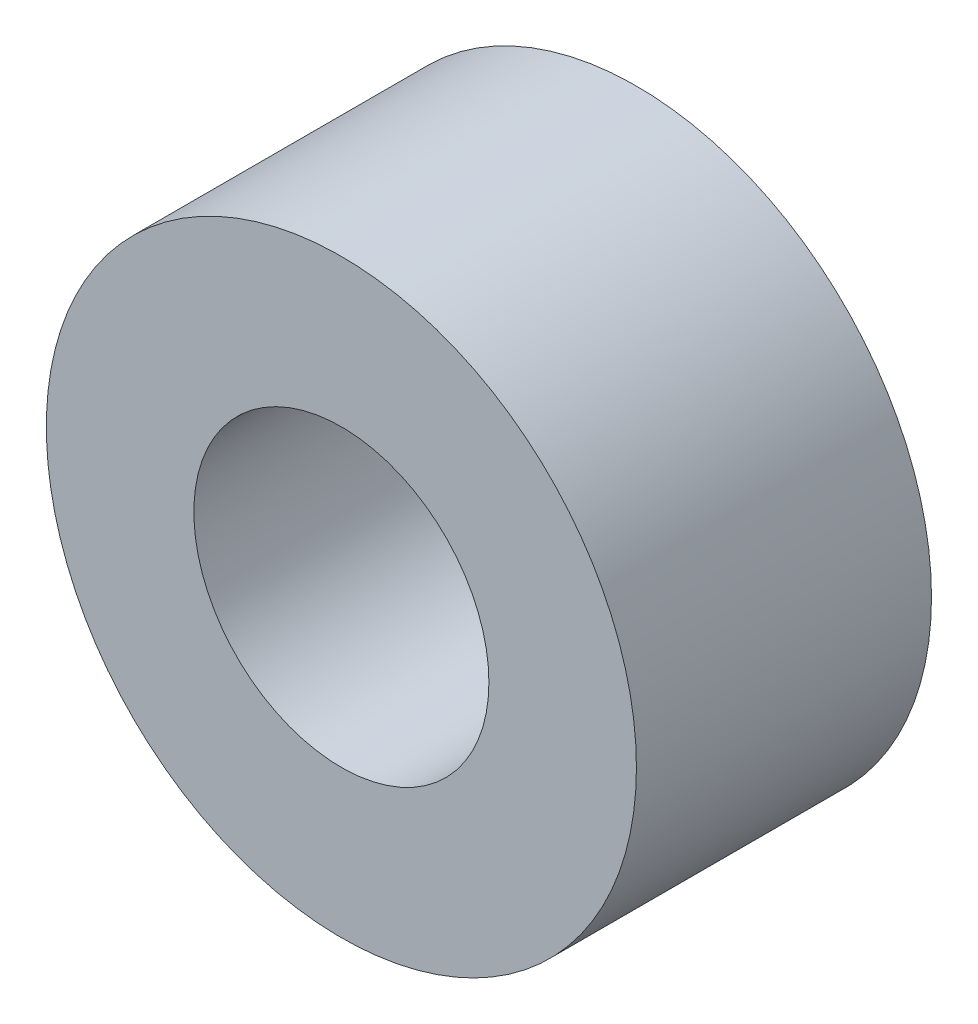
ISO-10303-21;
HEADER;
FILE_DESCRIPTION(('STEP AP214'),'2;1');
FILE_NAME('part.step','',(''),(''),'','','');
FILE_SCHEMA(('AUTOMOTIVE_DESIGN { 1 0 10303 214 1 1 1 1 }'));
ENDSEC;
DATA;
#1=APPLICATION_CONTEXT('core data for automotive mechanical design processes');
#2=APPLICATION_PROTOCOL_DEFINITION('international standard','automotive_design',2000,#1);
#3=PRODUCT_CONTEXT('',#1,'mechanical');
#4=PRODUCT('Part','Part','',(#3));
#5=PRODUCT_RELATED_PRODUCT_CATEGORY('part','',(#4));
#6=PRODUCT_DEFINITION_FORMATION('','',#4);
#7=PRODUCT_DEFINITION_CONTEXT('part definition',#1,'design');
#8=PRODUCT_DEFINITION('design','',#6,#7);
#9=PRODUCT_DEFINITION_SHAPE('','',#8);
#10=(LENGTH_UNIT() NAMED_UNIT(*) SI_UNIT(.MILLI.,.METRE.));
#11=(NAMED_UNIT(*) PLANE_ANGLE_UNIT() SI_UNIT($,.RADIAN.));
#12=(NAMED_UNIT(*) SI_UNIT($,.STERADIAN.) SOLID_ANGLE_UNIT());
#13=UNCERTAINTY_MEASURE_WITH_UNIT(LENGTH_MEASURE(1.E-05),#10,'distance_accuracy_value','');
#14=(GEOMETRIC_REPRESENTATION_CONTEXT(3) GLOBAL_UNCERTAINTY_ASSIGNED_CONTEXT((#13)) GLOBAL_UNIT_ASSIGNED_CONTEXT((#10,
#11,#12)) REPRESENTATION_CONTEXT('',''));
#15=CARTESIAN_POINT('',(0.,0.,0.));
#16=DIRECTION('',(0.,0.,1.));
#17=DIRECTION('',(1.,0.,0.));
#18=AXIS2_PLACEMENT_3D('',#15,#16,#17);
#19=CARTESIAN_POINT('',(0.,0.,1.5));
#20=DIRECTION('',(0.,0.,1.));
#21=DIRECTION('',(1.,0.,0.));
#22=AXIS2_PLACEMENT_3D('',#19,#20,#21);
#23=PLANE('',#22);
#24=CARTESIAN_POINT('',(0.,0.,1.5));
#25=DIRECTION('',(0.,0.,1.));
#26=DIRECTION('',(1.,0.,0.));
#27=AXIS2_PLACEMENT_3D('',#24,#25,#26);
#28=CIRCLE('',#27,3.);
#29=CARTESIAN_POINT('',(3.,0.,1.5));
#30=VERTEX_POINT('',#29);
#31=EDGE_CURVE('E10',#30,#30,#28,.T.);
#32=ORIENTED_EDGE('',*,*,#31,.T.);
#33=EDGE_LOOP('',(#32));
#34=FACE_BOUND('',#33,.T.);
#35=CARTESIAN_POINT('',(0.,0.,1.5));
#36=DIRECTION('',(0.,0.,1.));
#37=DIRECTION('',(1.,0.,0.));
#38=AXIS2_PLACEMENT_3D('',#35,#36,#37);
#39=CIRCLE('',#38,1.5);
#40=CARTESIAN_POINT('',(1.5,0.,1.5));
#41=VERTEX_POINT('',#40);
#42=EDGE_CURVE('E42',#41,#41,#39,.T.);
#43=ORIENTED_EDGE('',*,*,#42,.F.);
#44=EDGE_LOOP('',(#43));
#45=FACE_BOUND('',#44,.T.);
#46=ADVANCED_FACE('F31',(#34,#45),#23,.T.);
#47=CARTESIAN_POINT('',(0.,0.,-1.5));
#48=DIRECTION('',(0.,0.,1.));
#49=DIRECTION('',(1.,0.,0.));
#50=AXIS2_PLACEMENT_3D('',#47,#48,#49);
#51=PLANE('',#50);
#52=CARTESIAN_POINT('',(0.,0.,-1.5));
#53=DIRECTION('',(0.,0.,1.));
#54=DIRECTION('',(1.,0.,0.));
#55=AXIS2_PLACEMENT_3D('',#52,#53,#54);
#56=CIRCLE('',#55,3.);
#57=CARTESIAN_POINT('',(3.,0.,-1.5));
#58=VERTEX_POINT('',#57);
#59=EDGE_CURVE('E35',#58,#58,#56,.T.);
#60=ORIENTED_EDGE('',*,*,#59,.F.);
#61=EDGE_LOOP('',(#60));
#62=FACE_BOUND('',#61,.T.);
#63=CARTESIAN_POINT('',(0.,0.,-1.5));
#64=DIRECTION('',(0.,0.,1.));
#65=DIRECTION('',(1.,0.,0.));
#66=AXIS2_PLACEMENT_3D('',#63,#64,#65);
#67=CIRCLE('',#66,1.5);
#68=CARTESIAN_POINT('',(1.5,0.,-1.5));
#69=VERTEX_POINT('',#68);
#70=EDGE_CURVE('E44',#69,#69,#67,.T.);
#71=ORIENTED_EDGE('',*,*,#70,.T.);
#72=EDGE_LOOP('',(#71));
#73=FACE_BOUND('',#72,.T.);
#74=ADVANCED_FACE('F54',(#62,#73),#51,.F.);
#75=CARTESIAN_POINT('',(0.,0.,1.5));
#76=DIRECTION('',(0.,0.,-1.));
#77=DIRECTION('',(-1.,0.,0.));
#78=AXIS2_PLACEMENT_3D('',#75,#76,#77);
#79=CYLINDRICAL_SURFACE('',#78,3.);
#80=ORIENTED_EDGE('',*,*,#31,.F.);
#81=EDGE_LOOP('',(#80));
#82=FACE_BOUND('',#81,.T.);
#83=ORIENTED_EDGE('',*,*,#59,.T.);
#84=EDGE_LOOP('',(#83));
#85=FACE_BOUND('',#84,.T.);
#86=ADVANCED_FACE('F33',(#82,#85),#79,.T.);
#87=CARTESIAN_POINT('',(0.,0.,1.5));
#88=DIRECTION('',(0.,0.,-1.));
#89=DIRECTION('',(-1.,0.,0.));
#90=AXIS2_PLACEMENT_3D('',#87,#88,#89);
#91=CYLINDRICAL_SURFACE('',#90,1.5);
#92=ORIENTED_EDGE('',*,*,#42,.T.);
#93=EDGE_LOOP('',(#92));
#94=FACE_BOUND('',#93,.T.);
#95=ORIENTED_EDGE('',*,*,#70,.F.);
#96=EDGE_LOOP('',(#95));
#97=FACE_BOUND('',#96,.T.);
#98=ADVANCED_FACE('F50',(#94,#97),#91,.F.);
#99=CLOSED_SHELL('',(#46,#74,#86,#98));
#100=MANIFOLD_SOLID_BREP('B2',#99);
#101=ADVANCED_BREP_SHAPE_REPRESENTATION('',(#18,#100),#14);
#102=SHAPE_DEFINITION_REPRESENTATION(#9,#101);
ENDSEC;
END-ISO-10303-21;
